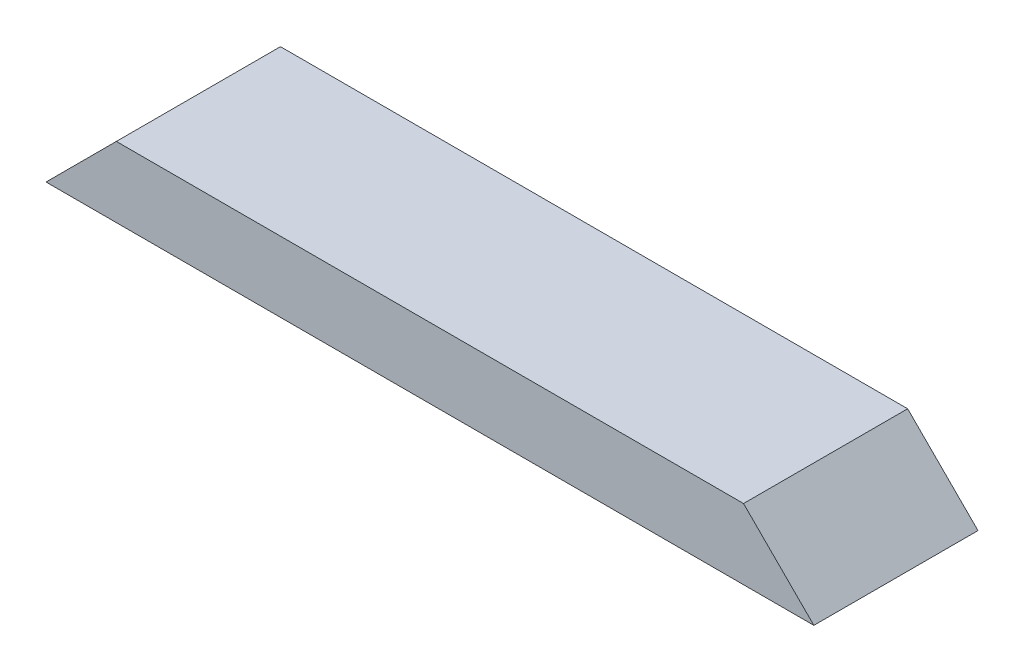
ISO-10303-21;
HEADER;
FILE_DESCRIPTION(('STEP AP214'),'2;1');
FILE_NAME('part.step','',(''),(''),'','','');
FILE_SCHEMA(('AUTOMOTIVE_DESIGN { 1 0 10303 214 1 1 1 1 }'));
ENDSEC;
DATA;
#1=APPLICATION_CONTEXT('core data for automotive mechanical design processes');
#2=APPLICATION_PROTOCOL_DEFINITION('international standard','automotive_design',2000,#1);
#3=PRODUCT_CONTEXT('',#1,'mechanical');
#4=PRODUCT('Part','Part','',(#3));
#5=PRODUCT_RELATED_PRODUCT_CATEGORY('part','',(#4));
#6=PRODUCT_DEFINITION_FORMATION('','',#4);
#7=PRODUCT_DEFINITION_CONTEXT('part definition',#1,'design');
#8=PRODUCT_DEFINITION('design','',#6,#7);
#9=PRODUCT_DEFINITION_SHAPE('','',#8);
#10=(LENGTH_UNIT() NAMED_UNIT(*) SI_UNIT(.MILLI.,.METRE.));
#11=(NAMED_UNIT(*) PLANE_ANGLE_UNIT() SI_UNIT($,.RADIAN.));
#12=(NAMED_UNIT(*) SI_UNIT($,.STERADIAN.) SOLID_ANGLE_UNIT());
#13=UNCERTAINTY_MEASURE_WITH_UNIT(LENGTH_MEASURE(1.E-05),#10,'distance_accuracy_value','');
#14=(GEOMETRIC_REPRESENTATION_CONTEXT(3) GLOBAL_UNCERTAINTY_ASSIGNED_CONTEXT((#13)) GLOBAL_UNIT_ASSIGNED_CONTEXT((#10,
#11,#12)) REPRESENTATION_CONTEXT('',''));
#15=CARTESIAN_POINT('',(0.,0.,0.));
#16=DIRECTION('',(0.,0.,1.));
#17=DIRECTION('',(1.,0.,0.));
#18=AXIS2_PLACEMENT_3D('',#15,#16,#17);
#19=CARTESIAN_POINT('',(0.,38.1,0.));
#20=DIRECTION('',(0.,0.,-1.));
#21=DIRECTION('',(-1.,0.,0.));
#22=AXIS2_PLACEMENT_3D('',#19,#20,#21);
#23=PLANE('',#22);
#24=DIRECTION('',(1.,0.,0.));
#25=VECTOR('',#24,1.);
#26=CARTESIAN_POINT('',(0.,38.1,0.));
#27=LINE('',#26,#25);
#28=CARTESIAN_POINT('',(38.1,38.1,0.));
#29=VERTEX_POINT('',#28);
#30=CARTESIAN_POINT('',(377.825,38.1,0.));
#31=VERTEX_POINT('',#30);
#32=EDGE_CURVE('E47',#29,#31,#27,.T.);
#33=ORIENTED_EDGE('',*,*,#32,.F.);
#34=DIRECTION('',(0.707106781186547,0.707106781186547,0.));
#35=VECTOR('',#34,1.);
#36=CARTESIAN_POINT('',(0.,0.,0.));
#37=LINE('',#36,#35);
#38=CARTESIAN_POINT('',(0.,0.,0.));
#39=VERTEX_POINT('',#38);
#40=EDGE_CURVE('E82',#39,#29,#37,.T.);
#41=ORIENTED_EDGE('',*,*,#40,.F.);
#42=DIRECTION('',(1.,0.,0.));
#43=VECTOR('',#42,1.);
#44=CARTESIAN_POINT('',(0.,0.,0.));
#45=LINE('',#44,#43);
#46=CARTESIAN_POINT('',(415.925,0.,0.));
#47=VERTEX_POINT('',#46);
#48=EDGE_CURVE('E87',#39,#47,#45,.T.);
#49=ORIENTED_EDGE('',*,*,#48,.T.);
#50=DIRECTION('',(0.707106781186548,-0.707106781186547,0.));
#51=VECTOR('',#50,1.);
#52=CARTESIAN_POINT('',(377.825,38.1,0.));
#53=LINE('',#52,#51);
#54=EDGE_CURVE('E63',#31,#47,#53,.T.);
#55=ORIENTED_EDGE('',*,*,#54,.F.);
#56=EDGE_LOOP('',(#33,#41,#49,#55));
#57=FACE_BOUND('',#56,.T.);
#58=ADVANCED_FACE('F39',(#57),#23,.F.);
#59=CARTESIAN_POINT('',(0.,38.1,-88.9));
#60=DIRECTION('',(0.,0.,1.));
#61=DIRECTION('',(1.,0.,0.));
#62=AXIS2_PLACEMENT_3D('',#59,#60,#61);
#63=PLANE('',#62);
#64=DIRECTION('',(-1.,0.,0.));
#65=VECTOR('',#64,1.);
#66=CARTESIAN_POINT('',(0.,0.,-88.9));
#67=LINE('',#66,#65);
#68=CARTESIAN_POINT('',(415.925,0.,-88.9));
#69=VERTEX_POINT('',#68);
#70=CARTESIAN_POINT('',(0.,0.,-88.9));
#71=VERTEX_POINT('',#70);
#72=EDGE_CURVE('E42',#69,#71,#67,.T.);
#73=ORIENTED_EDGE('',*,*,#72,.T.);
#74=DIRECTION('',(0.707106781186547,0.707106781186547,0.));
#75=VECTOR('',#74,1.);
#76=CARTESIAN_POINT('',(0.,0.,-88.9));
#77=LINE('',#76,#75);
#78=CARTESIAN_POINT('',(38.1,38.1,-88.9));
#79=VERTEX_POINT('',#78);
#80=EDGE_CURVE('E55',#71,#79,#77,.T.);
#81=ORIENTED_EDGE('',*,*,#80,.T.);
#82=DIRECTION('',(-1.,0.,0.));
#83=VECTOR('',#82,1.);
#84=CARTESIAN_POINT('',(0.,38.1,-88.9));
#85=LINE('',#84,#83);
#86=CARTESIAN_POINT('',(377.825,38.1,-88.9));
#87=VERTEX_POINT('',#86);
#88=EDGE_CURVE('E11',#87,#79,#85,.T.);
#89=ORIENTED_EDGE('',*,*,#88,.F.);
#90=DIRECTION('',(0.707106781186548,-0.707106781186547,0.));
#91=VECTOR('',#90,1.);
#92=CARTESIAN_POINT('',(377.825,38.1,-88.9));
#93=LINE('',#92,#91);
#94=EDGE_CURVE('E100',#87,#69,#93,.T.);
#95=ORIENTED_EDGE('',*,*,#94,.T.);
#96=EDGE_LOOP('',(#73,#81,#89,#95));
#97=FACE_BOUND('',#96,.T.);
#98=ADVANCED_FACE('F109',(#97),#63,.F.);
#99=CARTESIAN_POINT('',(0.,38.1,0.));
#100=DIRECTION('',(0.,-1.,0.));
#101=DIRECTION('',(0.,0.,-1.));
#102=AXIS2_PLACEMENT_3D('',#99,#100,#101);
#103=PLANE('',#102);
#104=ORIENTED_EDGE('',*,*,#88,.T.);
#105=DIRECTION('',(0.,0.,1.));
#106=VECTOR('',#105,1.);
#107=CARTESIAN_POINT('',(38.1,38.1,-88.9));
#108=LINE('',#107,#106);
#109=EDGE_CURVE('E88',#79,#29,#108,.T.);
#110=ORIENTED_EDGE('',*,*,#109,.T.);
#111=ORIENTED_EDGE('',*,*,#32,.T.);
#112=DIRECTION('',(0.,0.,1.));
#113=VECTOR('',#112,1.);
#114=CARTESIAN_POINT('',(377.825,38.1,-88.9));
#115=LINE('',#114,#113);
#116=EDGE_CURVE('E103',#87,#31,#115,.T.);
#117=ORIENTED_EDGE('',*,*,#116,.F.);
#118=EDGE_LOOP('',(#104,#110,#111,#117));
#119=FACE_BOUND('',#118,.T.);
#120=ADVANCED_FACE('F112',(#119),#103,.F.);
#121=CARTESIAN_POINT('',(0.,0.,0.));
#122=DIRECTION('',(0.,-1.,0.));
#123=DIRECTION('',(0.,0.,-1.));
#124=AXIS2_PLACEMENT_3D('',#121,#122,#123);
#125=PLANE('',#124);
#126=DIRECTION('',(0.,0.,1.));
#127=VECTOR('',#126,1.);
#128=CARTESIAN_POINT('',(0.,0.,0.));
#129=LINE('',#128,#127);
#130=EDGE_CURVE('E79',#71,#39,#129,.T.);
#131=ORIENTED_EDGE('',*,*,#130,.F.);
#132=ORIENTED_EDGE('',*,*,#72,.F.);
#133=DIRECTION('',(0.,0.,-1.));
#134=VECTOR('',#133,1.);
#135=CARTESIAN_POINT('',(415.925,0.,0.));
#136=LINE('',#135,#134);
#137=EDGE_CURVE('E96',#47,#69,#136,.T.);
#138=ORIENTED_EDGE('',*,*,#137,.F.);
#139=ORIENTED_EDGE('',*,*,#48,.F.);
#140=EDGE_LOOP('',(#131,#132,#138,#139));
#141=FACE_BOUND('',#140,.T.);
#142=ADVANCED_FACE('F95',(#141),#125,.T.);
#143=CARTESIAN_POINT('',(377.825,38.1,-88.9));
#144=DIRECTION('',(-0.707106781186547,-0.707106781186548,0.));
#145=DIRECTION('',(0.707106781186548,-0.707106781186547,0.));
#146=AXIS2_PLACEMENT_3D('',#143,#144,#145);
#147=PLANE('',#146);
#148=ORIENTED_EDGE('',*,*,#54,.T.);
#149=ORIENTED_EDGE('',*,*,#137,.T.);
#150=ORIENTED_EDGE('',*,*,#94,.F.);
#151=ORIENTED_EDGE('',*,*,#116,.T.);
#152=EDGE_LOOP('',(#148,#149,#150,#151));
#153=FACE_BOUND('',#152,.T.);
#154=ADVANCED_FACE('F113',(#153),#147,.F.);
#155=CARTESIAN_POINT('',(0.,0.,-88.9));
#156=DIRECTION('',(0.707106781186547,-0.707106781186547,0.));
#157=DIRECTION('',(0.707106781186548,0.707106781186548,0.));
#158=AXIS2_PLACEMENT_3D('',#155,#156,#157);
#159=PLANE('',#158);
#160=ORIENTED_EDGE('',*,*,#40,.T.);
#161=ORIENTED_EDGE('',*,*,#109,.F.);
#162=ORIENTED_EDGE('',*,*,#80,.F.);
#163=ORIENTED_EDGE('',*,*,#130,.T.);
#164=EDGE_LOOP('',(#160,#161,#162,#163));
#165=FACE_BOUND('',#164,.T.);
#166=ADVANCED_FACE('F81',(#165),#159,.F.);
#167=CLOSED_SHELL('',(#58,#98,#120,#142,#154,#166));
#168=MANIFOLD_SOLID_BREP('B2',#167);
#169=ADVANCED_BREP_SHAPE_REPRESENTATION('',(#18,#168),#14);
#170=SHAPE_DEFINITION_REPRESENTATION(#9,#169);
ENDSEC;
END-ISO-10303-21;
